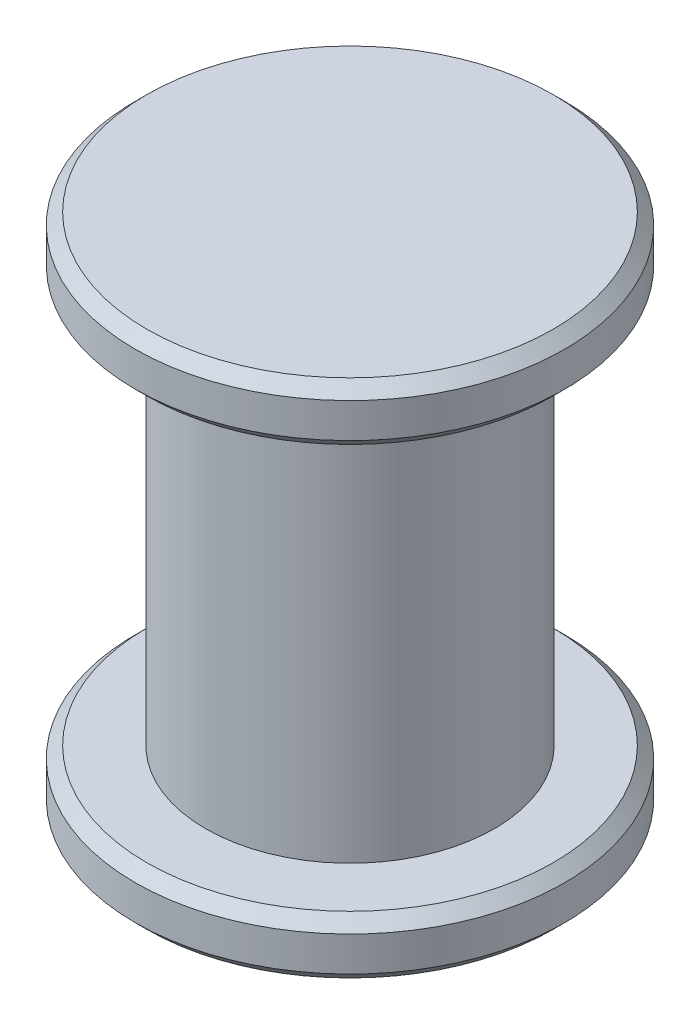
ISO-10303-21;
HEADER;
FILE_DESCRIPTION(('STEP AP214'),'2;1');
FILE_NAME('part.step','',(''),(''),'','','');
FILE_SCHEMA(('AUTOMOTIVE_DESIGN { 1 0 10303 214 1 1 1 1 }'));
ENDSEC;
DATA;
#1=APPLICATION_CONTEXT('core data for automotive mechanical design processes');
#2=APPLICATION_PROTOCOL_DEFINITION('international standard','automotive_design',2000,#1);
#3=PRODUCT_CONTEXT('',#1,'mechanical');
#4=PRODUCT('Part','Part','',(#3));
#5=PRODUCT_RELATED_PRODUCT_CATEGORY('part','',(#4));
#6=PRODUCT_DEFINITION_FORMATION('','',#4);
#7=PRODUCT_DEFINITION_CONTEXT('part definition',#1,'design');
#8=PRODUCT_DEFINITION('design','',#6,#7);
#9=PRODUCT_DEFINITION_SHAPE('','',#8);
#10=(LENGTH_UNIT() NAMED_UNIT(*) SI_UNIT(.MILLI.,.METRE.));
#11=(NAMED_UNIT(*) PLANE_ANGLE_UNIT() SI_UNIT($,.RADIAN.));
#12=(NAMED_UNIT(*) SI_UNIT($,.STERADIAN.) SOLID_ANGLE_UNIT());
#13=UNCERTAINTY_MEASURE_WITH_UNIT(LENGTH_MEASURE(1.E-05),#10,'distance_accuracy_value','');
#14=(GEOMETRIC_REPRESENTATION_CONTEXT(3) GLOBAL_UNCERTAINTY_ASSIGNED_CONTEXT((#13)) GLOBAL_UNIT_ASSIGNED_CONTEXT((#10,
#11,#12)) REPRESENTATION_CONTEXT('',''));
#15=CARTESIAN_POINT('',(0.,0.,0.));
#16=DIRECTION('',(0.,0.,1.));
#17=DIRECTION('',(1.,0.,0.));
#18=AXIS2_PLACEMENT_3D('',#15,#16,#17);
#19=CARTESIAN_POINT('',(0.,0.7,0.));
#20=DIRECTION('',(0.,-1.,0.));
#21=DIRECTION('',(0.,0.,-1.));
#22=AXIS2_PLACEMENT_3D('',#19,#20,#21);
#23=CYLINDRICAL_SURFACE('',#22,0.25);
#24=CARTESIAN_POINT('',(0.,0.7,0.));
#25=DIRECTION('',(0.,1.,0.));
#26=DIRECTION('',(0.,0.,1.));
#27=AXIS2_PLACEMENT_3D('',#24,#25,#26);
#28=CIRCLE('',#27,0.25);
#29=CARTESIAN_POINT('',(0.,0.7,0.25));
#30=VERTEX_POINT('',#29);
#31=EDGE_CURVE('E77',#30,#30,#28,.T.);
#32=ORIENTED_EDGE('',*,*,#31,.F.);
#33=EDGE_LOOP('',(#32));
#34=FACE_BOUND('',#33,.T.);
#35=CARTESIAN_POINT('',(0.,0.,0.));
#36=DIRECTION('',(0.,1.,0.));
#37=DIRECTION('',(0.,0.,1.));
#38=AXIS2_PLACEMENT_3D('',#35,#36,#37);
#39=CIRCLE('',#38,0.25);
#40=CARTESIAN_POINT('',(0.,0.,0.25));
#41=VERTEX_POINT('',#40);
#42=EDGE_CURVE('E78',#41,#41,#39,.T.);
#43=ORIENTED_EDGE('',*,*,#42,.T.);
#44=EDGE_LOOP('',(#43));
#45=FACE_BOUND('',#44,.T.);
#46=ADVANCED_FACE('F37',(#34,#45),#23,.T.);
#47=CARTESIAN_POINT('',(0.,0.8,0.));
#48=DIRECTION('',(0.,-1.,0.));
#49=DIRECTION('',(0.,0.,-1.));
#50=AXIS2_PLACEMENT_3D('',#47,#48,#49);
#51=CYLINDRICAL_SURFACE('',#50,0.371871199051348);
#52=CARTESIAN_POINT('',(0.,0.72,0.));
#53=DIRECTION('',(0.,1.,0.));
#54=DIRECTION('',(0.,0.,1.));
#55=AXIS2_PLACEMENT_3D('',#52,#53,#54);
#56=CIRCLE('',#55,0.371871199051348);
#57=CARTESIAN_POINT('',(0.,0.72,0.371871199051348));
#58=VERTEX_POINT('',#57);
#59=EDGE_CURVE('E55',#58,#58,#56,.T.);
#60=ORIENTED_EDGE('',*,*,#59,.T.);
#61=EDGE_LOOP('',(#60));
#62=FACE_BOUND('',#61,.T.);
#63=CARTESIAN_POINT('',(0.,0.78,0.));
#64=DIRECTION('',(0.,1.,0.));
#65=DIRECTION('',(0.,0.,1.));
#66=AXIS2_PLACEMENT_3D('',#63,#64,#65);
#67=CIRCLE('',#66,0.371871199051348);
#68=CARTESIAN_POINT('',(0.,0.78,0.371871199051348));
#69=VERTEX_POINT('',#68);
#70=EDGE_CURVE('E69',#69,#69,#67,.F.);
#71=ORIENTED_EDGE('',*,*,#70,.T.);
#72=EDGE_LOOP('',(#71));
#73=FACE_BOUND('',#72,.T.);
#74=ADVANCED_FACE('F90',(#62,#73),#51,.T.);
#75=CARTESIAN_POINT('',(0.,0.8,0.));
#76=DIRECTION('',(0.,1.,0.));
#77=DIRECTION('',(0.,0.,1.));
#78=AXIS2_PLACEMENT_3D('',#75,#76,#77);
#79=PLANE('',#78);
#80=CARTESIAN_POINT('',(0.,0.8,0.));
#81=DIRECTION('',(0.,1.,0.));
#82=DIRECTION('',(0.,0.,1.));
#83=AXIS2_PLACEMENT_3D('',#80,#81,#82);
#84=CIRCLE('',#83,0.351871199051348);
#85=CARTESIAN_POINT('',(0.,0.8,0.351871199051348));
#86=VERTEX_POINT('',#85);
#87=EDGE_CURVE('E73',#86,#86,#84,.T.);
#88=ORIENTED_EDGE('',*,*,#87,.T.);
#89=EDGE_LOOP('',(#88));
#90=FACE_BOUND('',#89,.T.);
#91=ADVANCED_FACE('F112',(#90),#79,.T.);
#92=CARTESIAN_POINT('',(0.,0.7,0.));
#93=DIRECTION('',(0.,1.,0.));
#94=DIRECTION('',(0.,0.,1.));
#95=AXIS2_PLACEMENT_3D('',#92,#93,#94);
#96=PLANE('',#95);
#97=CARTESIAN_POINT('',(0.,0.7,0.));
#98=DIRECTION('',(0.,1.,0.));
#99=DIRECTION('',(0.,0.,1.));
#100=AXIS2_PLACEMENT_3D('',#97,#98,#99);
#101=CIRCLE('',#100,0.351871199051348);
#102=CARTESIAN_POINT('',(0.,0.7,0.351871199051348));
#103=VERTEX_POINT('',#102);
#104=EDGE_CURVE('E50',#103,#103,#101,.F.);
#105=ORIENTED_EDGE('',*,*,#104,.T.);
#106=EDGE_LOOP('',(#105));
#107=FACE_BOUND('',#106,.T.);
#108=ORIENTED_EDGE('',*,*,#31,.T.);
#109=EDGE_LOOP('',(#108));
#110=FACE_BOUND('',#109,.T.);
#111=ADVANCED_FACE('F86',(#107,#110),#96,.F.);
#112=CARTESIAN_POINT('',(0.,-0.1,0.));
#113=DIRECTION('',(0.,1.,0.));
#114=DIRECTION('',(0.,0.,1.));
#115=AXIS2_PLACEMENT_3D('',#112,#113,#114);
#116=CYLINDRICAL_SURFACE('',#115,0.371871199051348);
#117=CARTESIAN_POINT('',(0.,-0.0800000000000001,0.));
#118=DIRECTION('',(0.,-1.,0.));
#119=DIRECTION('',(0.,0.,-1.));
#120=AXIS2_PLACEMENT_3D('',#117,#118,#119);
#121=CIRCLE('',#120,0.371871199051348);
#122=CARTESIAN_POINT('',(0.,-0.0800000000000001,-0.371871199051348));
#123=VERTEX_POINT('',#122);
#124=EDGE_CURVE('E10',#123,#123,#121,.F.);
#125=ORIENTED_EDGE('',*,*,#124,.T.);
#126=EDGE_LOOP('',(#125));
#127=FACE_BOUND('',#126,.T.);
#128=CARTESIAN_POINT('',(0.,-0.0200000000000002,0.));
#129=DIRECTION('',(0.,-1.,0.));
#130=DIRECTION('',(0.,0.,-1.));
#131=AXIS2_PLACEMENT_3D('',#128,#129,#130);
#132=CIRCLE('',#131,0.371871199051348);
#133=CARTESIAN_POINT('',(0.,-0.0200000000000002,-0.371871199051348));
#134=VERTEX_POINT('',#133);
#135=EDGE_CURVE('E65',#134,#134,#132,.T.);
#136=ORIENTED_EDGE('',*,*,#135,.T.);
#137=EDGE_LOOP('',(#136));
#138=FACE_BOUND('',#137,.T.);
#139=ADVANCED_FACE('F107',(#127,#138),#116,.T.);
#140=CARTESIAN_POINT('',(0.,-0.1,0.));
#141=DIRECTION('',(0.,-1.,0.));
#142=DIRECTION('',(0.,0.,-1.));
#143=AXIS2_PLACEMENT_3D('',#140,#141,#142);
#144=PLANE('',#143);
#145=CARTESIAN_POINT('',(0.,-0.1,0.));
#146=DIRECTION('',(0.,-1.,0.));
#147=DIRECTION('',(0.,0.,-1.));
#148=AXIS2_PLACEMENT_3D('',#145,#146,#147);
#149=CIRCLE('',#148,0.351871199051348);
#150=CARTESIAN_POINT('',(0.,-0.1,-0.351871199051348));
#151=VERTEX_POINT('',#150);
#152=EDGE_CURVE('E45',#151,#151,#149,.T.);
#153=ORIENTED_EDGE('',*,*,#152,.T.);
#154=EDGE_LOOP('',(#153));
#155=FACE_BOUND('',#154,.T.);
#156=ADVANCED_FACE('F97',(#155),#144,.T.);
#157=CARTESIAN_POINT('',(0.,0.,0.));
#158=DIRECTION('',(0.,-1.,0.));
#159=DIRECTION('',(0.,0.,-1.));
#160=AXIS2_PLACEMENT_3D('',#157,#158,#159);
#161=PLANE('',#160);
#162=CARTESIAN_POINT('',(0.,0.,0.));
#163=DIRECTION('',(0.,-1.,0.));
#164=DIRECTION('',(0.,0.,-1.));
#165=AXIS2_PLACEMENT_3D('',#162,#163,#164);
#166=CIRCLE('',#165,0.351871199051348);
#167=CARTESIAN_POINT('',(0.,0.,-0.351871199051348));
#168=VERTEX_POINT('',#167);
#169=EDGE_CURVE('E61',#168,#168,#166,.F.);
#170=ORIENTED_EDGE('',*,*,#169,.T.);
#171=EDGE_LOOP('',(#170));
#172=FACE_BOUND('',#171,.T.);
#173=ORIENTED_EDGE('',*,*,#42,.F.);
#174=EDGE_LOOP('',(#173));
#175=FACE_BOUND('',#174,.T.);
#176=ADVANCED_FACE('F94',(#172,#175),#161,.F.);
#177=CARTESIAN_POINT('',(0.,0.8,0.));
#178=DIRECTION('',(0.,-1.,0.));
#179=DIRECTION('',(0.,0.,-1.));
#180=AXIS2_PLACEMENT_3D('',#177,#178,#179);
#181=CONICAL_SURFACE('',#180,0.351871199051348,0.78539816339745);
#182=ORIENTED_EDGE('',*,*,#70,.F.);
#183=EDGE_LOOP('',(#182));
#184=FACE_BOUND('',#183,.T.);
#185=ORIENTED_EDGE('',*,*,#87,.F.);
#186=EDGE_LOOP('',(#185));
#187=FACE_BOUND('',#186,.T.);
#188=ADVANCED_FACE('F96',(#184,#187),#181,.T.);
#189=CARTESIAN_POINT('',(0.,-0.0200000000000002,0.));
#190=DIRECTION('',(0.,-1.,0.));
#191=DIRECTION('',(0.,0.,-1.));
#192=AXIS2_PLACEMENT_3D('',#189,#190,#191);
#193=CONICAL_SURFACE('',#192,0.371871199051348,0.785398163397448);
#194=ORIENTED_EDGE('',*,*,#169,.F.);
#195=EDGE_LOOP('',(#194));
#196=FACE_BOUND('',#195,.T.);
#197=ORIENTED_EDGE('',*,*,#135,.F.);
#198=EDGE_LOOP('',(#197));
#199=FACE_BOUND('',#198,.T.);
#200=ADVANCED_FACE('F104',(#196,#199),#193,.T.);
#201=CARTESIAN_POINT('',(0.,0.72,0.));
#202=DIRECTION('',(0.,1.,0.));
#203=DIRECTION('',(0.,0.,1.));
#204=AXIS2_PLACEMENT_3D('',#201,#202,#203);
#205=CONICAL_SURFACE('',#204,0.371871199051348,0.785398163397452);
#206=ORIENTED_EDGE('',*,*,#104,.F.);
#207=EDGE_LOOP('',(#206));
#208=FACE_BOUND('',#207,.T.);
#209=ORIENTED_EDGE('',*,*,#59,.F.);
#210=EDGE_LOOP('',(#209));
#211=FACE_BOUND('',#210,.T.);
#212=ADVANCED_FACE('F123',(#208,#211),#205,.T.);
#213=CARTESIAN_POINT('',(0.,-0.1,0.));
#214=DIRECTION('',(0.,1.,0.));
#215=DIRECTION('',(0.,0.,1.));
#216=AXIS2_PLACEMENT_3D('',#213,#214,#215);
#217=CONICAL_SURFACE('',#216,0.351871199051348,0.785398163397452);
#218=ORIENTED_EDGE('',*,*,#124,.F.);
#219=EDGE_LOOP('',(#218));
#220=FACE_BOUND('',#219,.T.);
#221=ORIENTED_EDGE('',*,*,#152,.F.);
#222=EDGE_LOOP('',(#221));
#223=FACE_BOUND('',#222,.T.);
#224=ADVANCED_FACE('F39',(#220,#223),#217,.T.);
#225=CLOSED_SHELL('',(#46,#74,#91,#111,#139,#156,#176,#188,#200,#212,#224));
#226=MANIFOLD_SOLID_BREP('B2',#225);
#227=ADVANCED_BREP_SHAPE_REPRESENTATION('',(#18,#226),#14);
#228=SHAPE_DEFINITION_REPRESENTATION(#9,#227);
ENDSEC;
END-ISO-10303-21;
